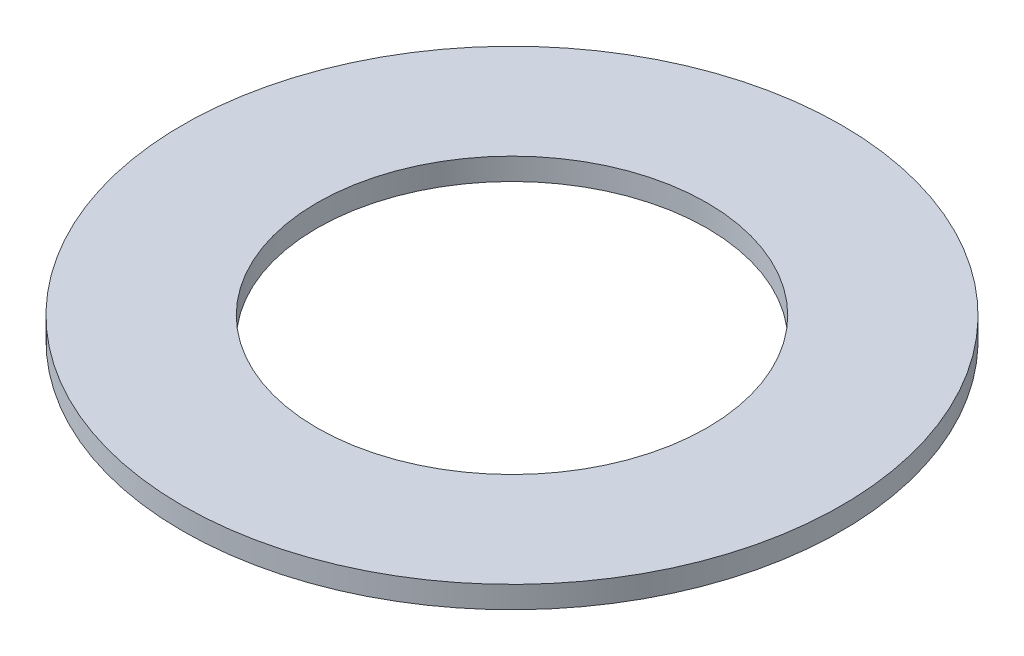
ISO-10303-21;
HEADER;
FILE_DESCRIPTION(('STEP AP214'),'2;1');
FILE_NAME('part.step','',(''),(''),'','','');
FILE_SCHEMA(('AUTOMOTIVE_DESIGN { 1 0 10303 214 1 1 1 1 }'));
ENDSEC;
DATA;
#1=APPLICATION_CONTEXT('core data for automotive mechanical design processes');
#2=APPLICATION_PROTOCOL_DEFINITION('international standard','automotive_design',2000,#1);
#3=PRODUCT_CONTEXT('',#1,'mechanical');
#4=PRODUCT('Part','Part','',(#3));
#5=PRODUCT_RELATED_PRODUCT_CATEGORY('part','',(#4));
#6=PRODUCT_DEFINITION_FORMATION('','',#4);
#7=PRODUCT_DEFINITION_CONTEXT('part definition',#1,'design');
#8=PRODUCT_DEFINITION('design','',#6,#7);
#9=PRODUCT_DEFINITION_SHAPE('','',#8);
#10=(LENGTH_UNIT() NAMED_UNIT(*) SI_UNIT(.MILLI.,.METRE.));
#11=(NAMED_UNIT(*) PLANE_ANGLE_UNIT() SI_UNIT($,.RADIAN.));
#12=(NAMED_UNIT(*) SI_UNIT($,.STERADIAN.) SOLID_ANGLE_UNIT());
#13=UNCERTAINTY_MEASURE_WITH_UNIT(LENGTH_MEASURE(1.E-05),#10,'distance_accuracy_value','');
#14=(GEOMETRIC_REPRESENTATION_CONTEXT(3) GLOBAL_UNCERTAINTY_ASSIGNED_CONTEXT((#13)) GLOBAL_UNIT_ASSIGNED_CONTEXT((#10,
#11,#12)) REPRESENTATION_CONTEXT('',''));
#15=CARTESIAN_POINT('',(0.,0.,0.));
#16=DIRECTION('',(0.,0.,1.));
#17=DIRECTION('',(1.,0.,0.));
#18=AXIS2_PLACEMENT_3D('',#15,#16,#17);
#19=CARTESIAN_POINT('',(0.,0.4,0.));
#20=DIRECTION('',(0.,1.,0.));
#21=DIRECTION('',(0.,0.,1.));
#22=AXIS2_PLACEMENT_3D('',#19,#20,#21);
#23=PLANE('',#22);
#24=CARTESIAN_POINT('',(0.,0.4,0.));
#25=DIRECTION('',(0.,1.,0.));
#26=DIRECTION('',(0.,0.,1.));
#27=AXIS2_PLACEMENT_3D('',#24,#25,#26);
#28=CIRCLE('',#27,6.);
#29=CARTESIAN_POINT('',(0.,0.4,6.));
#30=VERTEX_POINT('',#29);
#31=EDGE_CURVE('E10',#30,#30,#28,.T.);
#32=ORIENTED_EDGE('',*,*,#31,.T.);
#33=EDGE_LOOP('',(#32));
#34=FACE_BOUND('',#33,.T.);
#35=CARTESIAN_POINT('',(0.,0.4,0.));
#36=DIRECTION('',(0.,1.,0.));
#37=DIRECTION('',(0.,0.,1.));
#38=AXIS2_PLACEMENT_3D('',#35,#36,#37);
#39=CIRCLE('',#38,3.55);
#40=CARTESIAN_POINT('',(0.,0.4,3.55));
#41=VERTEX_POINT('',#40);
#42=EDGE_CURVE('E43',#41,#41,#39,.T.);
#43=ORIENTED_EDGE('',*,*,#42,.F.);
#44=EDGE_LOOP('',(#43));
#45=FACE_BOUND('',#44,.T.);
#46=ADVANCED_FACE('F32',(#34,#45),#23,.T.);
#47=CARTESIAN_POINT('',(0.,0.,0.));
#48=DIRECTION('',(0.,1.,0.));
#49=DIRECTION('',(0.,0.,1.));
#50=AXIS2_PLACEMENT_3D('',#47,#48,#49);
#51=PLANE('',#50);
#52=CARTESIAN_POINT('',(0.,0.,0.));
#53=DIRECTION('',(0.,1.,0.));
#54=DIRECTION('',(0.,0.,1.));
#55=AXIS2_PLACEMENT_3D('',#52,#53,#54);
#56=CIRCLE('',#55,6.);
#57=CARTESIAN_POINT('',(0.,0.,6.));
#58=VERTEX_POINT('',#57);
#59=EDGE_CURVE('E36',#58,#58,#56,.T.);
#60=ORIENTED_EDGE('',*,*,#59,.F.);
#61=EDGE_LOOP('',(#60));
#62=FACE_BOUND('',#61,.T.);
#63=CARTESIAN_POINT('',(0.,0.,0.));
#64=DIRECTION('',(0.,1.,0.));
#65=DIRECTION('',(0.,0.,1.));
#66=AXIS2_PLACEMENT_3D('',#63,#64,#65);
#67=CIRCLE('',#66,3.55);
#68=CARTESIAN_POINT('',(0.,0.,3.55));
#69=VERTEX_POINT('',#68);
#70=EDGE_CURVE('E45',#69,#69,#67,.T.);
#71=ORIENTED_EDGE('',*,*,#70,.T.);
#72=EDGE_LOOP('',(#71));
#73=FACE_BOUND('',#72,.T.);
#74=ADVANCED_FACE('F55',(#62,#73),#51,.F.);
#75=CARTESIAN_POINT('',(0.,0.4,0.));
#76=DIRECTION('',(0.,-1.,0.));
#77=DIRECTION('',(0.,0.,-1.));
#78=AXIS2_PLACEMENT_3D('',#75,#76,#77);
#79=CYLINDRICAL_SURFACE('',#78,6.);
#80=ORIENTED_EDGE('',*,*,#31,.F.);
#81=EDGE_LOOP('',(#80));
#82=FACE_BOUND('',#81,.T.);
#83=ORIENTED_EDGE('',*,*,#59,.T.);
#84=EDGE_LOOP('',(#83));
#85=FACE_BOUND('',#84,.T.);
#86=ADVANCED_FACE('F34',(#82,#85),#79,.T.);
#87=CARTESIAN_POINT('',(0.,0.4,0.));
#88=DIRECTION('',(0.,-1.,0.));
#89=DIRECTION('',(0.,0.,-1.));
#90=AXIS2_PLACEMENT_3D('',#87,#88,#89);
#91=CYLINDRICAL_SURFACE('',#90,3.55);
#92=ORIENTED_EDGE('',*,*,#42,.T.);
#93=EDGE_LOOP('',(#92));
#94=FACE_BOUND('',#93,.T.);
#95=ORIENTED_EDGE('',*,*,#70,.F.);
#96=EDGE_LOOP('',(#95));
#97=FACE_BOUND('',#96,.T.);
#98=ADVANCED_FACE('F51',(#94,#97),#91,.F.);
#99=CLOSED_SHELL('',(#46,#74,#86,#98));
#100=MANIFOLD_SOLID_BREP('B2',#99);
#101=ADVANCED_BREP_SHAPE_REPRESENTATION('',(#18,#100),#14);
#102=SHAPE_DEFINITION_REPRESENTATION(#9,#101);
ENDSEC;
END-ISO-10303-21;
